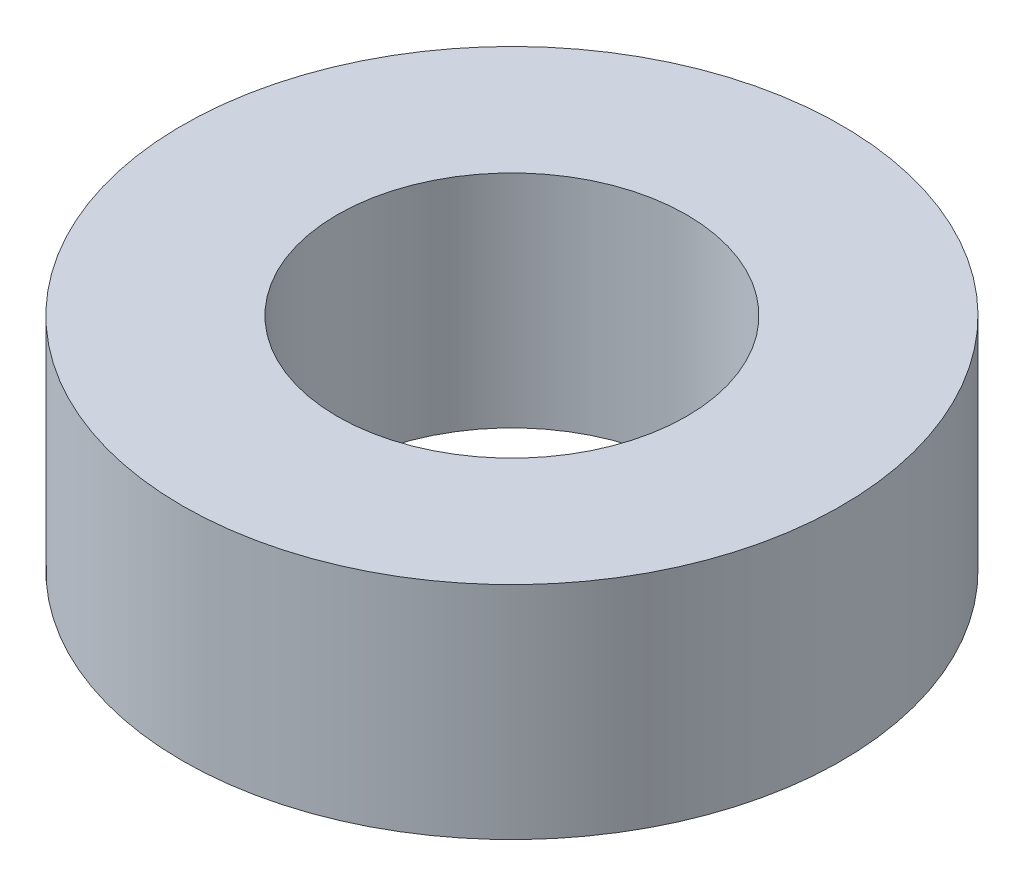
ISO-10303-21;
HEADER;
FILE_DESCRIPTION(('STEP AP214'),'2;1');
FILE_NAME('part.step','',(''),(''),'','','');
FILE_SCHEMA(('AUTOMOTIVE_DESIGN { 1 0 10303 214 1 1 1 1 }'));
ENDSEC;
DATA;
#1=APPLICATION_CONTEXT('core data for automotive mechanical design processes');
#2=APPLICATION_PROTOCOL_DEFINITION('international standard','automotive_design',2000,#1);
#3=PRODUCT_CONTEXT('',#1,'mechanical');
#4=PRODUCT('Part','Part','',(#3));
#5=PRODUCT_RELATED_PRODUCT_CATEGORY('part','',(#4));
#6=PRODUCT_DEFINITION_FORMATION('','',#4);
#7=PRODUCT_DEFINITION_CONTEXT('part definition',#1,'design');
#8=PRODUCT_DEFINITION('design','',#6,#7);
#9=PRODUCT_DEFINITION_SHAPE('','',#8);
#10=(LENGTH_UNIT() NAMED_UNIT(*) SI_UNIT(.MILLI.,.METRE.));
#11=(NAMED_UNIT(*) PLANE_ANGLE_UNIT() SI_UNIT($,.RADIAN.));
#12=(NAMED_UNIT(*) SI_UNIT($,.STERADIAN.) SOLID_ANGLE_UNIT());
#13=UNCERTAINTY_MEASURE_WITH_UNIT(LENGTH_MEASURE(1.E-05),#10,'distance_accuracy_value','');
#14=(GEOMETRIC_REPRESENTATION_CONTEXT(3) GLOBAL_UNCERTAINTY_ASSIGNED_CONTEXT((#13)) GLOBAL_UNIT_ASSIGNED_CONTEXT((#10,
#11,#12)) REPRESENTATION_CONTEXT('',''));
#15=CARTESIAN_POINT('',(0.,0.,0.));
#16=DIRECTION('',(0.,0.,1.));
#17=DIRECTION('',(1.,0.,0.));
#18=AXIS2_PLACEMENT_3D('',#15,#16,#17);
#19=CARTESIAN_POINT('',(0.,3.35,0.));
#20=DIRECTION('',(0.,1.,0.));
#21=DIRECTION('',(0.,0.,1.));
#22=AXIS2_PLACEMENT_3D('',#19,#20,#21);
#23=PLANE('',#22);
#24=CARTESIAN_POINT('',(0.,3.35,0.));
#25=DIRECTION('',(0.,1.,0.));
#26=DIRECTION('',(0.,0.,1.));
#27=AXIS2_PLACEMENT_3D('',#24,#25,#26);
#28=CIRCLE('',#27,5.);
#29=CARTESIAN_POINT('',(0.,3.35,5.));
#30=VERTEX_POINT('',#29);
#31=EDGE_CURVE('E10',#30,#30,#28,.T.);
#32=ORIENTED_EDGE('',*,*,#31,.T.);
#33=EDGE_LOOP('',(#32));
#34=FACE_BOUND('',#33,.T.);
#35=CARTESIAN_POINT('',(0.,3.35,0.));
#36=DIRECTION('',(0.,1.,0.));
#37=DIRECTION('',(0.,0.,1.));
#38=AXIS2_PLACEMENT_3D('',#35,#36,#37);
#39=CIRCLE('',#38,2.65);
#40=CARTESIAN_POINT('',(0.,3.35,2.65));
#41=VERTEX_POINT('',#40);
#42=EDGE_CURVE('E44',#41,#41,#39,.T.);
#43=ORIENTED_EDGE('',*,*,#42,.F.);
#44=EDGE_LOOP('',(#43));
#45=FACE_BOUND('',#44,.T.);
#46=ADVANCED_FACE('F33',(#34,#45),#23,.T.);
#47=CARTESIAN_POINT('',(0.,0.,0.));
#48=DIRECTION('',(0.,1.,0.));
#49=DIRECTION('',(0.,0.,1.));
#50=AXIS2_PLACEMENT_3D('',#47,#48,#49);
#51=PLANE('',#50);
#52=CARTESIAN_POINT('',(0.,0.,0.));
#53=DIRECTION('',(0.,1.,0.));
#54=DIRECTION('',(0.,0.,1.));
#55=AXIS2_PLACEMENT_3D('',#52,#53,#54);
#56=CIRCLE('',#55,5.);
#57=CARTESIAN_POINT('',(0.,0.,5.));
#58=VERTEX_POINT('',#57);
#59=EDGE_CURVE('E37',#58,#58,#56,.T.);
#60=ORIENTED_EDGE('',*,*,#59,.F.);
#61=EDGE_LOOP('',(#60));
#62=FACE_BOUND('',#61,.T.);
#63=CARTESIAN_POINT('',(0.,0.,0.));
#64=DIRECTION('',(0.,1.,0.));
#65=DIRECTION('',(0.,0.,1.));
#66=AXIS2_PLACEMENT_3D('',#63,#64,#65);
#67=CIRCLE('',#66,2.65);
#68=CARTESIAN_POINT('',(0.,0.,2.65));
#69=VERTEX_POINT('',#68);
#70=EDGE_CURVE('E46',#69,#69,#67,.T.);
#71=ORIENTED_EDGE('',*,*,#70,.T.);
#72=EDGE_LOOP('',(#71));
#73=FACE_BOUND('',#72,.T.);
#74=ADVANCED_FACE('F56',(#62,#73),#51,.F.);
#75=CARTESIAN_POINT('',(0.,3.35,0.));
#76=DIRECTION('',(0.,-1.,0.));
#77=DIRECTION('',(0.,0.,-1.));
#78=AXIS2_PLACEMENT_3D('',#75,#76,#77);
#79=CYLINDRICAL_SURFACE('',#78,5.);
#80=ORIENTED_EDGE('',*,*,#31,.F.);
#81=EDGE_LOOP('',(#80));
#82=FACE_BOUND('',#81,.T.);
#83=ORIENTED_EDGE('',*,*,#59,.T.);
#84=EDGE_LOOP('',(#83));
#85=FACE_BOUND('',#84,.T.);
#86=ADVANCED_FACE('F35',(#82,#85),#79,.T.);
#87=CARTESIAN_POINT('',(0.,3.35,0.));
#88=DIRECTION('',(0.,-1.,0.));
#89=DIRECTION('',(0.,0.,-1.));
#90=AXIS2_PLACEMENT_3D('',#87,#88,#89);
#91=CYLINDRICAL_SURFACE('',#90,2.65);
#92=ORIENTED_EDGE('',*,*,#42,.T.);
#93=EDGE_LOOP('',(#92));
#94=FACE_BOUND('',#93,.T.);
#95=ORIENTED_EDGE('',*,*,#70,.F.);
#96=EDGE_LOOP('',(#95));
#97=FACE_BOUND('',#96,.T.);
#98=ADVANCED_FACE('F52',(#94,#97),#91,.F.);
#99=CLOSED_SHELL('',(#46,#74,#86,#98));
#100=MANIFOLD_SOLID_BREP('B2',#99);
#101=ADVANCED_BREP_SHAPE_REPRESENTATION('',(#18,#100),#14);
#102=SHAPE_DEFINITION_REPRESENTATION(#9,#101);
ENDSEC;
END-ISO-10303-21;
